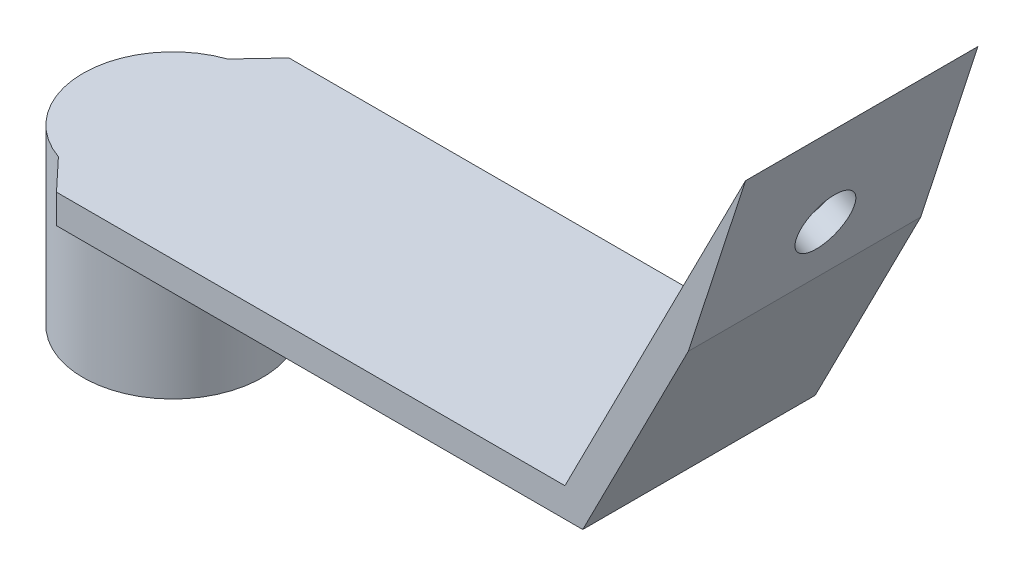
ISO-10303-21;
HEADER;
FILE_DESCRIPTION(('STEP AP214'),'2;1');
FILE_NAME('part.step','',(''),(''),'','','');
FILE_SCHEMA(('AUTOMOTIVE_DESIGN { 1 0 10303 214 1 1 1 1 }'));
ENDSEC;
DATA;
#1=APPLICATION_CONTEXT('core data for automotive mechanical design processes');
#2=APPLICATION_PROTOCOL_DEFINITION('international standard','automotive_design',2000,#1);
#3=PRODUCT_CONTEXT('',#1,'mechanical');
#4=PRODUCT('Part','Part','',(#3));
#5=PRODUCT_RELATED_PRODUCT_CATEGORY('part','',(#4));
#6=PRODUCT_DEFINITION_FORMATION('','',#4);
#7=PRODUCT_DEFINITION_CONTEXT('part definition',#1,'design');
#8=PRODUCT_DEFINITION('design','',#6,#7);
#9=PRODUCT_DEFINITION_SHAPE('','',#8);
#10=(LENGTH_UNIT() NAMED_UNIT(*) SI_UNIT(.MILLI.,.METRE.));
#11=(NAMED_UNIT(*) PLANE_ANGLE_UNIT() SI_UNIT($,.RADIAN.));
#12=(NAMED_UNIT(*) SI_UNIT($,.STERADIAN.) SOLID_ANGLE_UNIT());
#13=UNCERTAINTY_MEASURE_WITH_UNIT(LENGTH_MEASURE(1.E-05),#10,'distance_accuracy_value','');
#14=(GEOMETRIC_REPRESENTATION_CONTEXT(3) GLOBAL_UNCERTAINTY_ASSIGNED_CONTEXT((#13)) GLOBAL_UNIT_ASSIGNED_CONTEXT((#10,
#11,#12)) REPRESENTATION_CONTEXT('',''));
#15=CARTESIAN_POINT('',(0.,0.,0.));
#16=DIRECTION('',(0.,0.,1.));
#17=DIRECTION('',(1.,0.,0.));
#18=AXIS2_PLACEMENT_3D('',#15,#16,#17);
#19=CARTESIAN_POINT('',(-76.4958191725442,-22.422180744699,12.7));
#20=DIRECTION('',(0.,1.,0.));
#21=DIRECTION('',(-1.,0.,0.));
#22=AXIS2_PLACEMENT_3D('',#19,#20,#21);
#23=CYLINDRICAL_SURFACE('',#22,7.07136802942698);
#24=CARTESIAN_POINT('',(-76.4958191725442,-22.422180744699,12.7));
#25=DIRECTION('',(0.,1.,0.));
#26=DIRECTION('',(-1.,0.,0.));
#27=AXIS2_PLACEMENT_3D('',#24,#25,#26);
#28=CIRCLE('',#27,7.07136802942698);
#29=CARTESIAN_POINT('',(-83.5671872019712,-22.422180744699,12.7));
#30=VERTEX_POINT('',#29);
#31=EDGE_CURVE('E180',#30,#30,#28,.T.);
#32=ORIENTED_EDGE('',*,*,#31,.F.);
#33=EDGE_LOOP('',(#32));
#34=FACE_BOUND('',#33,.T.);
#35=CARTESIAN_POINT('',(-76.4958191725442,-6.59718074469901,12.7));
#36=DIRECTION('',(0.,1.,0.));
#37=DIRECTION('',(-1.,0.,0.));
#38=AXIS2_PLACEMENT_3D('',#35,#36,#37);
#39=CIRCLE('',#38,7.07136802942698);
#40=CARTESIAN_POINT('',(-83.5671872019712,-6.59718074469901,12.7));
#41=VERTEX_POINT('',#40);
#42=EDGE_CURVE('E186',#41,#41,#39,.T.);
#43=ORIENTED_EDGE('',*,*,#42,.T.);
#44=EDGE_LOOP('',(#43));
#45=FACE_BOUND('',#44,.T.);
#46=ADVANCED_FACE('F34',(#34,#45),#23,.F.);
#47=CARTESIAN_POINT('',(-76.4958191725442,-6.59718074469901,25.4));
#48=DIRECTION('',(0.,1.,0.));
#49=DIRECTION('',(-1.,0.,0.));
#50=AXIS2_PLACEMENT_3D('',#47,#48,#49);
#51=PLANE('',#50);
#52=ORIENTED_EDGE('',*,*,#42,.F.);
#53=EDGE_LOOP('',(#52));
#54=FACE_BOUND('',#53,.T.);
#55=ADVANCED_FACE('F212',(#54),#51,.F.);
#56=DIRECTION('',(1.,0.,0.));
#57=VECTOR('',#56,1.);
#58=CARTESIAN_POINT('',(-76.4958191725442,-6.59718074469901,25.4));
#59=LINE('',#58,#57);
#60=CARTESIAN_POINT('',(-76.4958191725442,-6.59718074469901,25.4));
#61=VERTEX_POINT('',#60);
#62=CARTESIAN_POINT('',(-18.9958191725442,-6.59718074469901,25.4));
#63=VERTEX_POINT('',#62);
#64=EDGE_CURVE('E85',#61,#63,#59,.T.);
#65=ORIENTED_EDGE('',*,*,#64,.F.);
#66=DIRECTION('',(0.684741103042188,0.,0.728786403416369));
#67=VECTOR('',#66,1.);
#68=CARTESIAN_POINT('',(-53.3045576529838,-6.59718074469901,50.0830166882614));
#69=LINE('',#68,#67);
#70=CARTESIAN_POINT('',(-79.7374183153331,-6.59718074469901,21.9498881692733));
#71=VERTEX_POINT('',#70);
#72=EDGE_CURVE('E109',#71,#61,#69,.T.);
#73=ORIENTED_EDGE('',*,*,#72,.F.);
#74=CARTESIAN_POINT('',(-76.4958191725442,-6.59718074469901,12.7));
#75=DIRECTION('',(0.,1.,0.));
#76=DIRECTION('',(-1.,0.,0.));
#77=AXIS2_PLACEMENT_3D('',#74,#75,#76);
#78=CIRCLE('',#77,9.80144867591482);
#79=CARTESIAN_POINT('',(-79.7374183153331,-6.59718074469901,3.45011183072667));
#80=VERTEX_POINT('',#79);
#81=EDGE_CURVE('E129',#71,#80,#78,.T.);
#82=ORIENTED_EDGE('',*,*,#81,.T.);
#83=DIRECTION('',(-0.684741103042188,0.,0.72878640341637));
#84=VECTOR('',#83,1.);
#85=CARTESIAN_POINT('',(-40.629195506744,-6.59718074469901,-38.1737090820974));
#86=LINE('',#85,#84);
#87=CARTESIAN_POINT('',(-76.4958191725442,-6.59718074469901,0.));
#88=VERTEX_POINT('',#87);
#89=EDGE_CURVE('E115',#88,#80,#86,.T.);
#90=ORIENTED_EDGE('',*,*,#89,.F.);
#91=DIRECTION('',(1.,0.,0.));
#92=VECTOR('',#91,1.);
#93=CARTESIAN_POINT('',(-76.4958191725442,-6.59718074469901,0.));
#94=LINE('',#93,#92);
#95=CARTESIAN_POINT('',(-18.9958191725442,-6.59718074469901,0.));
#96=VERTEX_POINT('',#95);
#97=EDGE_CURVE('E140',#88,#96,#94,.T.);
#98=ORIENTED_EDGE('',*,*,#97,.T.);
#99=DIRECTION('',(0.,0.,-1.));
#100=VECTOR('',#99,1.);
#101=CARTESIAN_POINT('',(-18.9958191725442,-6.59718074469901,25.4));
#102=LINE('',#101,#100);
#103=EDGE_CURVE('E118',#63,#96,#102,.T.);
#104=ORIENTED_EDGE('',*,*,#103,.F.);
#105=EDGE_LOOP('',(#65,#73,#82,#90,#98,#104));
#106=FACE_BOUND('',#105,.T.);
#107=ADVANCED_FACE('F36',(#106),#51,.F.);
#108=CARTESIAN_POINT('',(-18.9958191725442,-6.59718074469901,25.4));
#109=DIRECTION('',(-0.891006524188369,0.453990499739544,0.));
#110=DIRECTION('',(-0.453990499739544,-0.891006524188369,0.));
#111=AXIS2_PLACEMENT_3D('',#108,#109,#110);
#112=PLANE('',#111);
#113=DIRECTION('',(0.453990499739544,0.891006524188369,0.));
#114=VECTOR('',#113,1.);
#115=CARTESIAN_POINT('',(-18.9958191725442,-6.59718074469901,0.));
#116=LINE('',#115,#114);
#117=CARTESIAN_POINT('',(-7.46446047915981,16.0343849696856,0.));
#118=VERTEX_POINT('',#117);
#119=EDGE_CURVE('E142',#96,#118,#116,.T.);
#120=ORIENTED_EDGE('',*,*,#119,.T.);
#121=DIRECTION('',(0.,0.,-1.));
#122=VECTOR('',#121,1.);
#123=CARTESIAN_POINT('',(-7.46446047915981,16.0343849696856,25.4));
#124=LINE('',#123,#122);
#125=CARTESIAN_POINT('',(-7.46446047915981,16.0343849696856,25.4));
#126=VERTEX_POINT('',#125);
#127=EDGE_CURVE('E150',#126,#118,#124,.T.);
#128=ORIENTED_EDGE('',*,*,#127,.F.);
#129=DIRECTION('',(0.453990499739544,0.891006524188369,0.));
#130=VECTOR('',#129,1.);
#131=CARTESIAN_POINT('',(-18.9958191725442,-6.59718074469901,25.4));
#132=LINE('',#131,#130);
#133=EDGE_CURVE('E120',#63,#126,#132,.T.);
#134=ORIENTED_EDGE('',*,*,#133,.F.);
#135=ORIENTED_EDGE('',*,*,#103,.T.);
#136=EDGE_LOOP('',(#120,#128,#134,#135));
#137=FACE_BOUND('',#136,.T.);
#138=ADVANCED_FACE('F155',(#137),#112,.F.);
#139=CARTESIAN_POINT('',(-7.46446047915981,16.0343849696856,25.4));
#140=DIRECTION('',(-0.95114167721911,0.308754773010586,0.));
#141=DIRECTION('',(-0.308754773010586,-0.95114167721911,0.));
#142=AXIS2_PLACEMENT_3D('',#139,#140,#141);
#143=PLANE('',#142);
#144=CARTESIAN_POINT('',(-5.17908782947511,23.0746426923322,12.7));
#145=DIRECTION('',(-0.95114167721911,0.308754773010586,0.));
#146=DIRECTION('',(0.308754773010586,0.95114167721911,0.));
#147=AXIS2_PLACEMENT_3D('',#144,#145,#146);
#148=ELLIPSE('',#147,3.21471727408513,3.175);
#149=CARTESIAN_POINT('',(-4.18652852722175,26.1322942721908,12.7));
#150=VERTEX_POINT('',#149);
#151=EDGE_CURVE('E172',#150,#150,#148,.T.);
#152=ORIENTED_EDGE('',*,*,#151,.T.);
#153=EDGE_LOOP('',(#152));
#154=FACE_BOUND('',#153,.T.);
#155=DIRECTION('',(0.308754773010586,0.95114167721911,0.));
#156=VECTOR('',#155,1.);
#157=CARTESIAN_POINT('',(-7.46446047915981,16.0343849696856,0.));
#158=LINE('',#157,#156);
#159=CARTESIAN_POINT('',(-1.20885062046166,35.3052490117665,0.));
#160=VERTEX_POINT('',#159);
#161=EDGE_CURVE('E144',#118,#160,#158,.T.);
#162=ORIENTED_EDGE('',*,*,#161,.T.);
#163=DIRECTION('',(0.,0.,-1.));
#164=VECTOR('',#163,1.);
#165=CARTESIAN_POINT('',(-1.20885062046166,35.3052490117665,25.4));
#166=LINE('',#165,#164);
#167=CARTESIAN_POINT('',(-1.20885062046166,35.3052490117665,25.4));
#168=VERTEX_POINT('',#167);
#169=EDGE_CURVE('E148',#168,#160,#166,.T.);
#170=ORIENTED_EDGE('',*,*,#169,.F.);
#171=DIRECTION('',(0.308754773010586,0.95114167721911,0.));
#172=VECTOR('',#171,1.);
#173=CARTESIAN_POINT('',(-7.46446047915981,16.0343849696856,25.4));
#174=LINE('',#173,#172);
#175=EDGE_CURVE('E133',#126,#168,#174,.T.);
#176=ORIENTED_EDGE('',*,*,#175,.F.);
#177=ORIENTED_EDGE('',*,*,#127,.T.);
#178=EDGE_LOOP('',(#162,#170,#176,#177));
#179=FACE_BOUND('',#178,.T.);
#180=ADVANCED_FACE('F165',(#154,#179),#143,.F.);
#181=CARTESIAN_POINT('',(-20.9414616748885,-3.42218074469901,25.4));
#182=DIRECTION('',(0.891006524188369,-0.453990499739544,0.));
#183=DIRECTION('',(0.453990499739544,0.891006524188369,0.));
#184=AXIS2_PLACEMENT_3D('',#181,#182,#183);
#185=PLANE('',#184);
#186=CARTESIAN_POINT('',(-6.97452996715387,23.9894661545742,12.7));
#187=DIRECTION('',(-0.891006524188369,0.453990499739544,0.));
#188=DIRECTION('',(-0.453990499739544,-0.891006524188369,0.));
#189=AXIS2_PLACEMENT_3D('',#186,#187,#188);
#190=CIRCLE('',#189,3.175);
#191=CARTESIAN_POINT('',(-8.41594980382692,21.1605204402761,12.7));
#192=VERTEX_POINT('',#191);
#193=EDGE_CURVE('E176',#192,#192,#190,.T.);
#194=ORIENTED_EDGE('',*,*,#193,.F.);
#195=EDGE_LOOP('',(#194));
#196=FACE_BOUND('',#195,.T.);
#197=DIRECTION('',(-0.453990499739544,-0.891006524188369,0.));
#198=VECTOR('',#197,1.);
#199=CARTESIAN_POINT('',(-20.9414616748885,-3.42218074469901,0.));
#200=LINE('',#199,#198);
#201=CARTESIAN_POINT('',(-20.9414616748885,-3.42218074469901,0.));
#202=VERTEX_POINT('',#201);
#203=EDGE_CURVE('E78',#160,#202,#200,.T.);
#204=ORIENTED_EDGE('',*,*,#203,.T.);
#205=DIRECTION('',(0.,0.,-1.));
#206=VECTOR('',#205,1.);
#207=CARTESIAN_POINT('',(-20.9414616748885,-3.42218074469901,25.4));
#208=LINE('',#207,#206);
#209=CARTESIAN_POINT('',(-20.9414616748885,-3.42218074469901,25.4));
#210=VERTEX_POINT('',#209);
#211=EDGE_CURVE('E137',#210,#202,#208,.T.);
#212=ORIENTED_EDGE('',*,*,#211,.F.);
#213=DIRECTION('',(-0.453990499739544,-0.891006524188369,0.));
#214=VECTOR('',#213,1.);
#215=CARTESIAN_POINT('',(-20.9414616748885,-3.42218074469901,25.4));
#216=LINE('',#215,#214);
#217=EDGE_CURVE('E57',#168,#210,#216,.T.);
#218=ORIENTED_EDGE('',*,*,#217,.F.);
#219=ORIENTED_EDGE('',*,*,#169,.T.);
#220=EDGE_LOOP('',(#204,#212,#218,#219));
#221=FACE_BOUND('',#220,.T.);
#222=ADVANCED_FACE('F167',(#196,#221),#185,.F.);
#223=CARTESIAN_POINT('',(-76.4958191725442,-3.42218074469901,25.4));
#224=DIRECTION('',(0.,-1.,0.));
#225=DIRECTION('',(1.,0.,0.));
#226=AXIS2_PLACEMENT_3D('',#223,#224,#225);
#227=PLANE('',#226);
#228=CARTESIAN_POINT('',(-76.4958191725442,-3.42218074469901,12.7));
#229=DIRECTION('',(0.,1.,0.));
#230=DIRECTION('',(-1.,0.,0.));
#231=AXIS2_PLACEMENT_3D('',#228,#229,#230);
#232=CIRCLE('',#231,9.80144867591482);
#233=CARTESIAN_POINT('',(-79.7374183153331,-3.42218074469901,3.45011183072667));
#234=VERTEX_POINT('',#233);
#235=CARTESIAN_POINT('',(-79.7374183153331,-3.42218074469901,21.9498881692733));
#236=VERTEX_POINT('',#235);
#237=EDGE_CURVE('E171',#234,#236,#232,.T.);
#238=ORIENTED_EDGE('',*,*,#237,.T.);
#239=DIRECTION('',(0.684741103042188,0.,0.728786403416369));
#240=VECTOR('',#239,1.);
#241=CARTESIAN_POINT('',(-53.3045576529838,-3.42218074469901,50.0830166882614));
#242=LINE('',#241,#240);
#243=CARTESIAN_POINT('',(-76.4958191725442,-3.42218074469901,25.4));
#244=VERTEX_POINT('',#243);
#245=EDGE_CURVE('E169',#236,#244,#242,.T.);
#246=ORIENTED_EDGE('',*,*,#245,.T.);
#247=DIRECTION('',(-1.,0.,0.));
#248=VECTOR('',#247,1.);
#249=CARTESIAN_POINT('',(-76.4958191725442,-3.42218074469901,25.4));
#250=LINE('',#249,#248);
#251=EDGE_CURVE('E124',#210,#244,#250,.T.);
#252=ORIENTED_EDGE('',*,*,#251,.F.);
#253=ORIENTED_EDGE('',*,*,#211,.T.);
#254=DIRECTION('',(-1.,0.,0.));
#255=VECTOR('',#254,1.);
#256=CARTESIAN_POINT('',(-76.4958191725442,-3.42218074469901,0.));
#257=LINE('',#256,#255);
#258=CARTESIAN_POINT('',(-76.4958191725442,-3.42218074469901,0.));
#259=VERTEX_POINT('',#258);
#260=EDGE_CURVE('E125',#202,#259,#257,.T.);
#261=ORIENTED_EDGE('',*,*,#260,.T.);
#262=DIRECTION('',(-0.684741103042188,0.,0.72878640341637));
#263=VECTOR('',#262,1.);
#264=CARTESIAN_POINT('',(-40.629195506744,-3.42218074469901,-38.1737090820974));
#265=LINE('',#264,#263);
#266=EDGE_CURVE('E49',#259,#234,#265,.T.);
#267=ORIENTED_EDGE('',*,*,#266,.T.);
#268=EDGE_LOOP('',(#238,#246,#252,#253,#261,#267));
#269=FACE_BOUND('',#268,.T.);
#270=ADVANCED_FACE('F168',(#269),#227,.F.);
#271=CARTESIAN_POINT('',(0.,0.,25.4));
#272=DIRECTION('',(0.,0.,1.));
#273=DIRECTION('',(1.,0.,0.));
#274=AXIS2_PLACEMENT_3D('',#271,#272,#273);
#275=PLANE('',#274);
#276=DIRECTION('',(0.,-1.,0.));
#277=VECTOR('',#276,1.);
#278=CARTESIAN_POINT('',(-76.4958191725442,-3.42218074469901,25.4));
#279=LINE('',#278,#277);
#280=EDGE_CURVE('E112',#244,#61,#279,.T.);
#281=ORIENTED_EDGE('',*,*,#280,.T.);
#282=ORIENTED_EDGE('',*,*,#64,.T.);
#283=ORIENTED_EDGE('',*,*,#133,.T.);
#284=ORIENTED_EDGE('',*,*,#175,.T.);
#285=ORIENTED_EDGE('',*,*,#217,.T.);
#286=ORIENTED_EDGE('',*,*,#251,.T.);
#287=EDGE_LOOP('',(#281,#282,#283,#284,#285,#286));
#288=FACE_BOUND('',#287,.T.);
#289=ADVANCED_FACE('F122',(#288),#275,.T.);
#290=CARTESIAN_POINT('',(0.,0.,0.));
#291=DIRECTION('',(0.,0.,1.));
#292=DIRECTION('',(1.,0.,0.));
#293=AXIS2_PLACEMENT_3D('',#290,#291,#292);
#294=PLANE('',#293);
#295=DIRECTION('',(0.,-1.,0.));
#296=VECTOR('',#295,1.);
#297=CARTESIAN_POINT('',(-76.4958191725442,-3.42218074469901,0.));
#298=LINE('',#297,#296);
#299=EDGE_CURVE('E138',#259,#88,#298,.T.);
#300=ORIENTED_EDGE('',*,*,#299,.F.);
#301=ORIENTED_EDGE('',*,*,#260,.F.);
#302=ORIENTED_EDGE('',*,*,#203,.F.);
#303=ORIENTED_EDGE('',*,*,#161,.F.);
#304=ORIENTED_EDGE('',*,*,#119,.F.);
#305=ORIENTED_EDGE('',*,*,#97,.F.);
#306=EDGE_LOOP('',(#300,#301,#302,#303,#304,#305));
#307=FACE_BOUND('',#306,.T.);
#308=ADVANCED_FACE('F161',(#307),#294,.F.);
#309=CARTESIAN_POINT('',(-76.4958191725442,-22.422180744699,12.7));
#310=DIRECTION('',(0.,1.,0.));
#311=DIRECTION('',(-1.,0.,0.));
#312=AXIS2_PLACEMENT_3D('',#309,#310,#311);
#313=CYLINDRICAL_SURFACE('',#312,9.80144867591482);
#314=DIRECTION('',(0.,1.,0.));
#315=VECTOR('',#314,1.);
#316=CARTESIAN_POINT('',(-79.7374183153331,-22.422180744699,21.9498881692733));
#317=LINE('',#316,#315);
#318=EDGE_CURVE('E42',#236,#71,#317,.F.);
#319=ORIENTED_EDGE('',*,*,#318,.F.);
#320=ORIENTED_EDGE('',*,*,#237,.F.);
#321=DIRECTION('',(0.,1.,0.));
#322=VECTOR('',#321,1.);
#323=CARTESIAN_POINT('',(-79.7374183153331,-22.422180744699,3.45011183072666));
#324=LINE('',#323,#322);
#325=EDGE_CURVE('E11',#80,#234,#324,.T.);
#326=ORIENTED_EDGE('',*,*,#325,.F.);
#327=ORIENTED_EDGE('',*,*,#81,.F.);
#328=EDGE_LOOP('',(#319,#320,#326,#327));
#329=FACE_BOUND('',#328,.T.);
#330=CARTESIAN_POINT('',(-76.4958191725442,-22.422180744699,12.7));
#331=DIRECTION('',(0.,1.,0.));
#332=DIRECTION('',(-1.,0.,0.));
#333=AXIS2_PLACEMENT_3D('',#330,#331,#332);
#334=CIRCLE('',#333,9.80144867591482);
#335=CARTESIAN_POINT('',(-86.297267848459,-22.422180744699,12.7));
#336=VERTEX_POINT('',#335);
#337=EDGE_CURVE('E183',#336,#336,#334,.T.);
#338=ORIENTED_EDGE('',*,*,#337,.T.);
#339=EDGE_LOOP('',(#338));
#340=FACE_BOUND('',#339,.T.);
#341=ADVANCED_FACE('F196',(#329,#340),#313,.T.);
#342=CARTESIAN_POINT('',(-76.4958191725442,-22.422180744699,12.7));
#343=DIRECTION('',(0.,1.,0.));
#344=DIRECTION('',(-1.,0.,0.));
#345=AXIS2_PLACEMENT_3D('',#342,#343,#344);
#346=PLANE('',#345);
#347=ORIENTED_EDGE('',*,*,#31,.T.);
#348=EDGE_LOOP('',(#347));
#349=FACE_BOUND('',#348,.T.);
#350=ORIENTED_EDGE('',*,*,#337,.F.);
#351=EDGE_LOOP('',(#350));
#352=FACE_BOUND('',#351,.T.);
#353=ADVANCED_FACE('F199',(#349,#352),#346,.F.);
#354=CARTESIAN_POINT('',(-53.3045576529838,-6.59718074469901,50.0830166882614));
#355=DIRECTION('',(-0.728786403416369,0.,0.684741103042188));
#356=DIRECTION('',(0.684741103042188,0.,0.728786403416369));
#357=AXIS2_PLACEMENT_3D('',#354,#355,#356);
#358=PLANE('',#357);
#359=ORIENTED_EDGE('',*,*,#245,.F.);
#360=ORIENTED_EDGE('',*,*,#318,.T.);
#361=ORIENTED_EDGE('',*,*,#72,.T.);
#362=ORIENTED_EDGE('',*,*,#280,.F.);
#363=EDGE_LOOP('',(#359,#360,#361,#362));
#364=FACE_BOUND('',#363,.T.);
#365=ADVANCED_FACE('F111',(#364),#358,.T.);
#366=CARTESIAN_POINT('',(-40.629195506744,-6.59718074469901,-38.1737090820974));
#367=DIRECTION('',(-0.72878640341637,0.,-0.684741103042188));
#368=DIRECTION('',(-0.684741103042188,0.,0.72878640341637));
#369=AXIS2_PLACEMENT_3D('',#366,#367,#368);
#370=PLANE('',#369);
#371=ORIENTED_EDGE('',*,*,#89,.T.);
#372=ORIENTED_EDGE('',*,*,#325,.T.);
#373=ORIENTED_EDGE('',*,*,#266,.F.);
#374=ORIENTED_EDGE('',*,*,#299,.T.);
#375=EDGE_LOOP('',(#371,#372,#373,#374));
#376=FACE_BOUND('',#375,.T.);
#377=ADVANCED_FACE('F195',(#376),#370,.T.);
#378=CARTESIAN_POINT('',(-4.1455842528558,22.5480463179012,12.7));
#379=DIRECTION('',(-0.891006524188369,0.453990499739544,0.));
#380=DIRECTION('',(-0.453990499739544,-0.891006524188369,0.));
#381=AXIS2_PLACEMENT_3D('',#378,#379,#380);
#382=CYLINDRICAL_SURFACE('',#381,3.175);
#383=ORIENTED_EDGE('',*,*,#193,.T.);
#384=EDGE_LOOP('',(#383));
#385=FACE_BOUND('',#384,.T.);
#386=ORIENTED_EDGE('',*,*,#151,.F.);
#387=EDGE_LOOP('',(#386));
#388=FACE_BOUND('',#387,.T.);
#389=ADVANCED_FACE('F222',(#385,#388),#382,.F.);
#390=CLOSED_SHELL('',(#46,#55,#107,#138,#180,#222,#270,#289,#308,#341,#353,#365,#377,#389));
#391=MANIFOLD_SOLID_BREP('B2',#390);
#392=ADVANCED_BREP_SHAPE_REPRESENTATION('',(#18,#391),#14);
#393=SHAPE_DEFINITION_REPRESENTATION(#9,#392);
ENDSEC;
END-ISO-10303-21;
